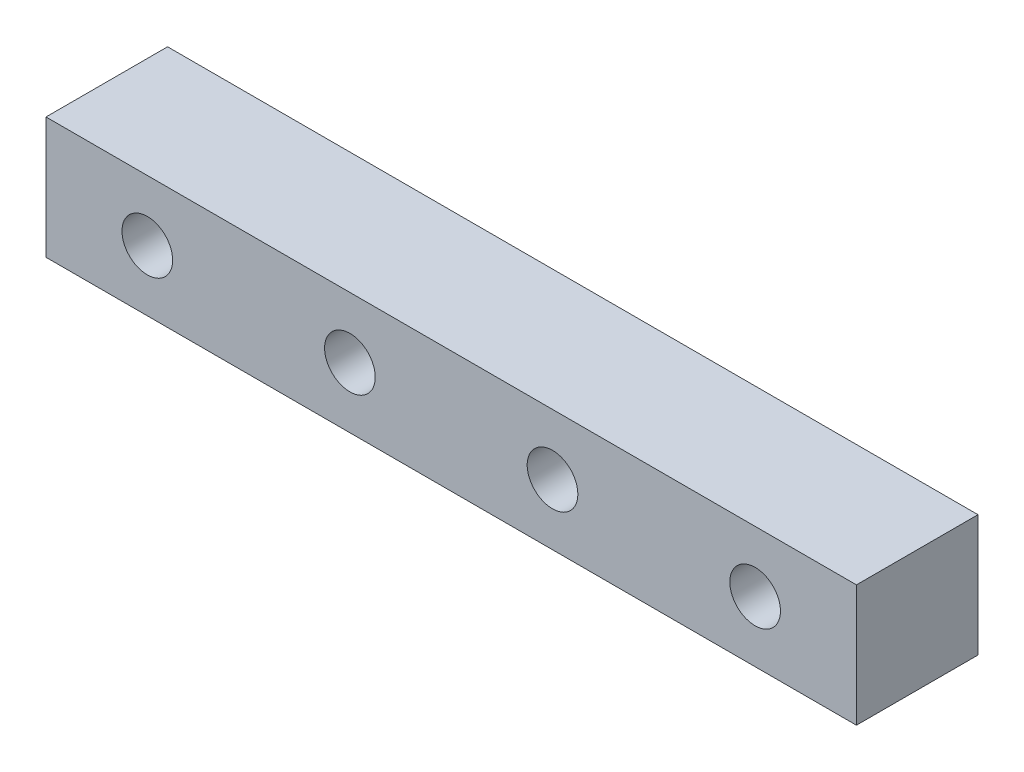
ISO-10303-21;
HEADER;
FILE_DESCRIPTION(('STEP AP214'),'2;1');
FILE_NAME('part.step','',(''),(''),'','','');
FILE_SCHEMA(('AUTOMOTIVE_DESIGN { 1 0 10303 214 1 1 1 1 }'));
ENDSEC;
DATA;
#1=APPLICATION_CONTEXT('core data for automotive mechanical design processes');
#2=APPLICATION_PROTOCOL_DEFINITION('international standard','automotive_design',2000,#1);
#3=PRODUCT_CONTEXT('',#1,'mechanical');
#4=PRODUCT('Part','Part','',(#3));
#5=PRODUCT_RELATED_PRODUCT_CATEGORY('part','',(#4));
#6=PRODUCT_DEFINITION_FORMATION('','',#4);
#7=PRODUCT_DEFINITION_CONTEXT('part definition',#1,'design');
#8=PRODUCT_DEFINITION('design','',#6,#7);
#9=PRODUCT_DEFINITION_SHAPE('','',#8);
#10=(LENGTH_UNIT() NAMED_UNIT(*) SI_UNIT(.MILLI.,.METRE.));
#11=(NAMED_UNIT(*) PLANE_ANGLE_UNIT() SI_UNIT($,.RADIAN.));
#12=(NAMED_UNIT(*) SI_UNIT($,.STERADIAN.) SOLID_ANGLE_UNIT());
#13=UNCERTAINTY_MEASURE_WITH_UNIT(LENGTH_MEASURE(1.E-05),#10,'distance_accuracy_value','');
#14=(GEOMETRIC_REPRESENTATION_CONTEXT(3) GLOBAL_UNCERTAINTY_ASSIGNED_CONTEXT((#13)) GLOBAL_UNIT_ASSIGNED_CONTEXT((#10,
#11,#12)) REPRESENTATION_CONTEXT('',''));
#15=CARTESIAN_POINT('',(0.,0.,0.));
#16=DIRECTION('',(0.,0.,1.));
#17=DIRECTION('',(1.,0.,0.));
#18=AXIS2_PLACEMENT_3D('',#15,#16,#17);
#19=CARTESIAN_POINT('',(0.,0.,6.));
#20=DIRECTION('',(0.,0.,-1.));
#21=DIRECTION('',(-1.,0.,0.));
#22=AXIS2_PLACEMENT_3D('',#19,#20,#21);
#23=PLANE('',#22);
#24=DIRECTION('',(0.,-1.,0.));
#25=VECTOR('',#24,1.);
#26=CARTESIAN_POINT('',(-5.,3.,6.));
#27=LINE('',#26,#25);
#28=CARTESIAN_POINT('',(-5.,3.,6.));
#29=VERTEX_POINT('',#28);
#30=CARTESIAN_POINT('',(-5.,-3.,6.));
#31=VERTEX_POINT('',#30);
#32=EDGE_CURVE('E90',#29,#31,#27,.T.);
#33=ORIENTED_EDGE('',*,*,#32,.T.);
#34=DIRECTION('',(1.,0.,0.));
#35=VECTOR('',#34,1.);
#36=CARTESIAN_POINT('',(35.,-3.,6.));
#37=LINE('',#36,#35);
#38=CARTESIAN_POINT('',(35.,-3.,6.));
#39=VERTEX_POINT('',#38);
#40=EDGE_CURVE('E85',#31,#39,#37,.T.);
#41=ORIENTED_EDGE('',*,*,#40,.T.);
#42=DIRECTION('',(0.,1.,0.));
#43=VECTOR('',#42,1.);
#44=CARTESIAN_POINT('',(35.,3.,6.));
#45=LINE('',#44,#43);
#46=CARTESIAN_POINT('',(35.,3.,6.));
#47=VERTEX_POINT('',#46);
#48=EDGE_CURVE('E88',#39,#47,#45,.T.);
#49=ORIENTED_EDGE('',*,*,#48,.T.);
#50=DIRECTION('',(-1.,0.,0.));
#51=VECTOR('',#50,1.);
#52=CARTESIAN_POINT('',(35.,3.,6.));
#53=LINE('',#52,#51);
#54=EDGE_CURVE('E55',#47,#29,#53,.T.);
#55=ORIENTED_EDGE('',*,*,#54,.T.);
#56=EDGE_LOOP('',(#33,#41,#49,#55));
#57=FACE_BOUND('',#56,.T.);
#58=CARTESIAN_POINT('',(0.,0.,6.));
#59=DIRECTION('',(0.,0.,1.));
#60=DIRECTION('',(1.,0.,0.));
#61=AXIS2_PLACEMENT_3D('',#58,#59,#60);
#62=CIRCLE('',#61,1.25);
#63=CARTESIAN_POINT('',(1.25,0.,6.));
#64=VERTEX_POINT('',#63);
#65=EDGE_CURVE('E105',#64,#64,#62,.T.);
#66=ORIENTED_EDGE('',*,*,#65,.F.);
#67=EDGE_LOOP('',(#66));
#68=FACE_BOUND('',#67,.T.);
#69=CARTESIAN_POINT('',(10.,0.,6.));
#70=DIRECTION('',(0.,0.,1.));
#71=DIRECTION('',(1.,0.,0.));
#72=AXIS2_PLACEMENT_3D('',#69,#70,#71);
#73=CIRCLE('',#72,1.25);
#74=CARTESIAN_POINT('',(11.25,0.,6.));
#75=VERTEX_POINT('',#74);
#76=EDGE_CURVE('E120',#75,#75,#73,.T.);
#77=ORIENTED_EDGE('',*,*,#76,.F.);
#78=EDGE_LOOP('',(#77));
#79=FACE_BOUND('',#78,.T.);
#80=CARTESIAN_POINT('',(20.,0.,6.));
#81=DIRECTION('',(0.,0.,1.));
#82=DIRECTION('',(1.,0.,0.));
#83=AXIS2_PLACEMENT_3D('',#80,#81,#82);
#84=CIRCLE('',#83,1.25);
#85=CARTESIAN_POINT('',(21.25,0.,6.));
#86=VERTEX_POINT('',#85);
#87=EDGE_CURVE('E126',#86,#86,#84,.T.);
#88=ORIENTED_EDGE('',*,*,#87,.F.);
#89=EDGE_LOOP('',(#88));
#90=FACE_BOUND('',#89,.T.);
#91=CARTESIAN_POINT('',(30.,0.,6.));
#92=DIRECTION('',(0.,0.,1.));
#93=DIRECTION('',(1.,0.,0.));
#94=AXIS2_PLACEMENT_3D('',#91,#92,#93);
#95=CIRCLE('',#94,1.25);
#96=CARTESIAN_POINT('',(31.25,0.,6.));
#97=VERTEX_POINT('',#96);
#98=EDGE_CURVE('E132',#97,#97,#95,.T.);
#99=ORIENTED_EDGE('',*,*,#98,.F.);
#100=EDGE_LOOP('',(#99));
#101=FACE_BOUND('',#100,.T.);
#102=ADVANCED_FACE('F38',(#57,#68,#79,#90,#101),#23,.F.);
#103=CARTESIAN_POINT('',(0.,0.,0.));
#104=DIRECTION('',(0.,0.,-1.));
#105=DIRECTION('',(-1.,0.,0.));
#106=AXIS2_PLACEMENT_3D('',#103,#104,#105);
#107=PLANE('',#106);
#108=CARTESIAN_POINT('',(20.,0.,0.));
#109=DIRECTION('',(0.,0.,1.));
#110=DIRECTION('',(1.,0.,0.));
#111=AXIS2_PLACEMENT_3D('',#108,#109,#110);
#112=CIRCLE('',#111,1.25);
#113=CARTESIAN_POINT('',(21.25,0.,0.));
#114=VERTEX_POINT('',#113);
#115=EDGE_CURVE('E129',#114,#114,#112,.T.);
#116=ORIENTED_EDGE('',*,*,#115,.T.);
#117=EDGE_LOOP('',(#116));
#118=FACE_BOUND('',#117,.T.);
#119=CARTESIAN_POINT('',(0.,0.,0.));
#120=DIRECTION('',(0.,0.,1.));
#121=DIRECTION('',(1.,0.,0.));
#122=AXIS2_PLACEMENT_3D('',#119,#120,#121);
#123=CIRCLE('',#122,1.25);
#124=CARTESIAN_POINT('',(1.25,0.,0.));
#125=VERTEX_POINT('',#124);
#126=EDGE_CURVE('E117',#125,#125,#123,.T.);
#127=ORIENTED_EDGE('',*,*,#126,.T.);
#128=EDGE_LOOP('',(#127));
#129=FACE_BOUND('',#128,.T.);
#130=DIRECTION('',(0.,-1.,0.));
#131=VECTOR('',#130,1.);
#132=CARTESIAN_POINT('',(-5.,3.,0.));
#133=LINE('',#132,#131);
#134=CARTESIAN_POINT('',(-5.,3.,0.));
#135=VERTEX_POINT('',#134);
#136=CARTESIAN_POINT('',(-5.,-3.,0.));
#137=VERTEX_POINT('',#136);
#138=EDGE_CURVE('E102',#135,#137,#133,.T.);
#139=ORIENTED_EDGE('',*,*,#138,.F.);
#140=DIRECTION('',(-1.,0.,0.));
#141=VECTOR('',#140,1.);
#142=CARTESIAN_POINT('',(35.,3.,0.));
#143=LINE('',#142,#141);
#144=CARTESIAN_POINT('',(35.,3.,0.));
#145=VERTEX_POINT('',#144);
#146=EDGE_CURVE('E78',#145,#135,#143,.T.);
#147=ORIENTED_EDGE('',*,*,#146,.F.);
#148=DIRECTION('',(0.,1.,0.));
#149=VECTOR('',#148,1.);
#150=CARTESIAN_POINT('',(35.,3.,0.));
#151=LINE('',#150,#149);
#152=CARTESIAN_POINT('',(35.,-3.,0.));
#153=VERTEX_POINT('',#152);
#154=EDGE_CURVE('E72',#153,#145,#151,.T.);
#155=ORIENTED_EDGE('',*,*,#154,.F.);
#156=DIRECTION('',(1.,0.,0.));
#157=VECTOR('',#156,1.);
#158=CARTESIAN_POINT('',(35.,-3.,0.));
#159=LINE('',#158,#157);
#160=EDGE_CURVE('E94',#137,#153,#159,.T.);
#161=ORIENTED_EDGE('',*,*,#160,.F.);
#162=EDGE_LOOP('',(#139,#147,#155,#161));
#163=FACE_BOUND('',#162,.T.);
#164=CARTESIAN_POINT('',(10.,0.,0.));
#165=DIRECTION('',(0.,0.,1.));
#166=DIRECTION('',(1.,0.,0.));
#167=AXIS2_PLACEMENT_3D('',#164,#165,#166);
#168=CIRCLE('',#167,1.25);
#169=CARTESIAN_POINT('',(11.25,0.,0.));
#170=VERTEX_POINT('',#169);
#171=EDGE_CURVE('E123',#170,#170,#168,.T.);
#172=ORIENTED_EDGE('',*,*,#171,.T.);
#173=EDGE_LOOP('',(#172));
#174=FACE_BOUND('',#173,.T.);
#175=CARTESIAN_POINT('',(30.,0.,0.));
#176=DIRECTION('',(0.,0.,1.));
#177=DIRECTION('',(1.,0.,0.));
#178=AXIS2_PLACEMENT_3D('',#175,#176,#177);
#179=CIRCLE('',#178,1.25);
#180=CARTESIAN_POINT('',(31.25,0.,0.));
#181=VERTEX_POINT('',#180);
#182=EDGE_CURVE('E135',#181,#181,#179,.T.);
#183=ORIENTED_EDGE('',*,*,#182,.T.);
#184=EDGE_LOOP('',(#183));
#185=FACE_BOUND('',#184,.T.);
#186=ADVANCED_FACE('F113',(#118,#129,#163,#174,#185),#107,.T.);
#187=CARTESIAN_POINT('',(-5.,3.,6.));
#188=DIRECTION('',(1.,0.,0.));
#189=DIRECTION('',(0.,1.,0.));
#190=AXIS2_PLACEMENT_3D('',#187,#188,#189);
#191=PLANE('',#190);
#192=ORIENTED_EDGE('',*,*,#138,.T.);
#193=DIRECTION('',(0.,0.,-1.));
#194=VECTOR('',#193,1.);
#195=CARTESIAN_POINT('',(-5.,-3.,6.));
#196=LINE('',#195,#194);
#197=EDGE_CURVE('E11',#31,#137,#196,.T.);
#198=ORIENTED_EDGE('',*,*,#197,.F.);
#199=ORIENTED_EDGE('',*,*,#32,.F.);
#200=DIRECTION('',(0.,0.,-1.));
#201=VECTOR('',#200,1.);
#202=CARTESIAN_POINT('',(-5.,3.,6.));
#203=LINE('',#202,#201);
#204=EDGE_CURVE('E98',#29,#135,#203,.T.);
#205=ORIENTED_EDGE('',*,*,#204,.T.);
#206=EDGE_LOOP('',(#192,#198,#199,#205));
#207=FACE_BOUND('',#206,.T.);
#208=ADVANCED_FACE('F40',(#207),#191,.F.);
#209=CARTESIAN_POINT('',(35.,-3.,6.));
#210=DIRECTION('',(0.,1.,0.));
#211=DIRECTION('',(-1.,0.,0.));
#212=AXIS2_PLACEMENT_3D('',#209,#210,#211);
#213=PLANE('',#212);
#214=ORIENTED_EDGE('',*,*,#160,.T.);
#215=DIRECTION('',(0.,0.,-1.));
#216=VECTOR('',#215,1.);
#217=CARTESIAN_POINT('',(35.,-3.,6.));
#218=LINE('',#217,#216);
#219=EDGE_CURVE('E47',#39,#153,#218,.T.);
#220=ORIENTED_EDGE('',*,*,#219,.F.);
#221=ORIENTED_EDGE('',*,*,#40,.F.);
#222=ORIENTED_EDGE('',*,*,#197,.T.);
#223=EDGE_LOOP('',(#214,#220,#221,#222));
#224=FACE_BOUND('',#223,.T.);
#225=ADVANCED_FACE('F93',(#224),#213,.F.);
#226=CARTESIAN_POINT('',(35.,3.,6.));
#227=DIRECTION('',(-1.,0.,0.));
#228=DIRECTION('',(0.,0.,1.));
#229=AXIS2_PLACEMENT_3D('',#226,#227,#228);
#230=PLANE('',#229);
#231=ORIENTED_EDGE('',*,*,#154,.T.);
#232=DIRECTION('',(0.,0.,-1.));
#233=VECTOR('',#232,1.);
#234=CARTESIAN_POINT('',(35.,3.,6.));
#235=LINE('',#234,#233);
#236=EDGE_CURVE('E95',#47,#145,#235,.T.);
#237=ORIENTED_EDGE('',*,*,#236,.F.);
#238=ORIENTED_EDGE('',*,*,#48,.F.);
#239=ORIENTED_EDGE('',*,*,#219,.T.);
#240=EDGE_LOOP('',(#231,#237,#238,#239));
#241=FACE_BOUND('',#240,.T.);
#242=ADVANCED_FACE('F96',(#241),#230,.F.);
#243=CARTESIAN_POINT('',(35.,3.,6.));
#244=DIRECTION('',(0.,-1.,0.));
#245=DIRECTION('',(1.,0.,0.));
#246=AXIS2_PLACEMENT_3D('',#243,#244,#245);
#247=PLANE('',#246);
#248=ORIENTED_EDGE('',*,*,#146,.T.);
#249=ORIENTED_EDGE('',*,*,#204,.F.);
#250=ORIENTED_EDGE('',*,*,#54,.F.);
#251=ORIENTED_EDGE('',*,*,#236,.T.);
#252=EDGE_LOOP('',(#248,#249,#250,#251));
#253=FACE_BOUND('',#252,.T.);
#254=ADVANCED_FACE('F110',(#253),#247,.F.);
#255=CARTESIAN_POINT('',(0.,0.,6.));
#256=DIRECTION('',(0.,0.,-1.));
#257=DIRECTION('',(-1.,0.,0.));
#258=AXIS2_PLACEMENT_3D('',#255,#256,#257);
#259=CYLINDRICAL_SURFACE('',#258,1.25);
#260=ORIENTED_EDGE('',*,*,#65,.T.);
#261=EDGE_LOOP('',(#260));
#262=FACE_BOUND('',#261,.T.);
#263=ORIENTED_EDGE('',*,*,#126,.F.);
#264=EDGE_LOOP('',(#263));
#265=FACE_BOUND('',#264,.T.);
#266=ADVANCED_FACE('F152',(#262,#265),#259,.F.);
#267=CARTESIAN_POINT('',(10.,0.,6.));
#268=DIRECTION('',(0.,0.,-1.));
#269=DIRECTION('',(-1.,0.,0.));
#270=AXIS2_PLACEMENT_3D('',#267,#268,#269);
#271=CYLINDRICAL_SURFACE('',#270,1.25);
#272=ORIENTED_EDGE('',*,*,#76,.T.);
#273=EDGE_LOOP('',(#272));
#274=FACE_BOUND('',#273,.T.);
#275=ORIENTED_EDGE('',*,*,#171,.F.);
#276=EDGE_LOOP('',(#275));
#277=FACE_BOUND('',#276,.T.);
#278=ADVANCED_FACE('F188',(#274,#277),#271,.F.);
#279=CARTESIAN_POINT('',(20.,0.,6.));
#280=DIRECTION('',(0.,0.,-1.));
#281=DIRECTION('',(-1.,0.,0.));
#282=AXIS2_PLACEMENT_3D('',#279,#280,#281);
#283=CYLINDRICAL_SURFACE('',#282,1.25);
#284=ORIENTED_EDGE('',*,*,#87,.T.);
#285=EDGE_LOOP('',(#284));
#286=FACE_BOUND('',#285,.T.);
#287=ORIENTED_EDGE('',*,*,#115,.F.);
#288=EDGE_LOOP('',(#287));
#289=FACE_BOUND('',#288,.T.);
#290=ADVANCED_FACE('F193',(#286,#289),#283,.F.);
#291=CARTESIAN_POINT('',(30.,0.,6.));
#292=DIRECTION('',(0.,0.,-1.));
#293=DIRECTION('',(-1.,0.,0.));
#294=AXIS2_PLACEMENT_3D('',#291,#292,#293);
#295=CYLINDRICAL_SURFACE('',#294,1.25);
#296=ORIENTED_EDGE('',*,*,#98,.T.);
#297=EDGE_LOOP('',(#296));
#298=FACE_BOUND('',#297,.T.);
#299=ORIENTED_EDGE('',*,*,#182,.F.);
#300=EDGE_LOOP('',(#299));
#301=FACE_BOUND('',#300,.T.);
#302=ADVANCED_FACE('F141',(#298,#301),#295,.F.);
#303=CLOSED_SHELL('',(#102,#186,#208,#225,#242,#254,#266,#278,#290,#302));
#304=MANIFOLD_SOLID_BREP('B2',#303);
#305=ADVANCED_BREP_SHAPE_REPRESENTATION('',(#18,#304),#14);
#306=SHAPE_DEFINITION_REPRESENTATION(#9,#305);
ENDSEC;
END-ISO-10303-21;
